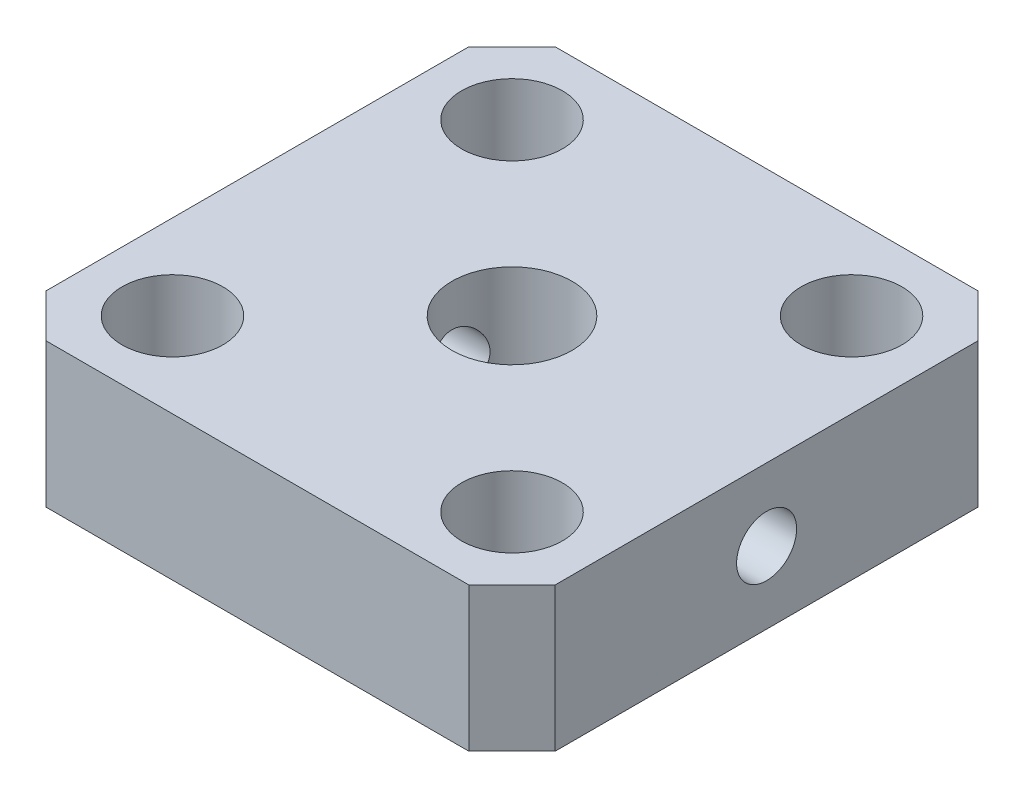
ISO-10303-21;
HEADER;
FILE_DESCRIPTION(('STEP AP214'),'2;1');
FILE_NAME('part.step','',(''),(''),'','','');
FILE_SCHEMA(('AUTOMOTIVE_DESIGN { 1 0 10303 214 1 1 1 1 }'));
ENDSEC;
DATA;
#1=APPLICATION_CONTEXT('core data for automotive mechanical design processes');
#2=APPLICATION_PROTOCOL_DEFINITION('international standard','automotive_design',2000,#1);
#3=PRODUCT_CONTEXT('',#1,'mechanical');
#4=PRODUCT('Part','Part','',(#3));
#5=PRODUCT_RELATED_PRODUCT_CATEGORY('part','',(#4));
#6=PRODUCT_DEFINITION_FORMATION('','',#4);
#7=PRODUCT_DEFINITION_CONTEXT('part definition',#1,'design');
#8=PRODUCT_DEFINITION('design','',#6,#7);
#9=PRODUCT_DEFINITION_SHAPE('','',#8);
#10=(LENGTH_UNIT() NAMED_UNIT(*) SI_UNIT(.MILLI.,.METRE.));
#11=(NAMED_UNIT(*) PLANE_ANGLE_UNIT() SI_UNIT($,.RADIAN.));
#12=(NAMED_UNIT(*) SI_UNIT($,.STERADIAN.) SOLID_ANGLE_UNIT());
#13=UNCERTAINTY_MEASURE_WITH_UNIT(LENGTH_MEASURE(1.E-05),#10,'distance_accuracy_value','');
#14=(GEOMETRIC_REPRESENTATION_CONTEXT(3) GLOBAL_UNCERTAINTY_ASSIGNED_CONTEXT((#13)) GLOBAL_UNIT_ASSIGNED_CONTEXT((#10,
#11,#12)) REPRESENTATION_CONTEXT('',''));
#15=CARTESIAN_POINT('',(0.,0.,0.));
#16=DIRECTION('',(0.,0.,1.));
#17=DIRECTION('',(1.,0.,0.));
#18=AXIS2_PLACEMENT_3D('',#15,#16,#17);
#19=CARTESIAN_POINT('',(0.,6.,0.));
#20=DIRECTION('',(0.,1.,0.));
#21=DIRECTION('',(0.,0.,1.));
#22=AXIS2_PLACEMENT_3D('',#19,#20,#21);
#23=PLANE('',#22);
#24=CARTESIAN_POINT('',(-7.07106781186546,6.,-7.07106781186549));
#25=DIRECTION('',(0.,1.,0.));
#26=DIRECTION('',(0.,0.,1.));
#27=AXIS2_PLACEMENT_3D('',#24,#25,#26);
#28=CIRCLE('',#27,2.09999999999999);
#29=CARTESIAN_POINT('',(-7.07106781186546,6.,-4.9710678118655));
#30=VERTEX_POINT('',#29);
#31=EDGE_CURVE('E272',#30,#30,#28,.T.);
#32=ORIENTED_EDGE('',*,*,#31,.F.);
#33=EDGE_LOOP('',(#32));
#34=FACE_BOUND('',#33,.T.);
#35=CARTESIAN_POINT('',(-7.07106781186546,6.,7.07106781186549));
#36=DIRECTION('',(0.,1.,0.));
#37=DIRECTION('',(0.,0.,1.));
#38=AXIS2_PLACEMENT_3D('',#35,#36,#37);
#39=CIRCLE('',#38,2.09999999999999);
#40=CARTESIAN_POINT('',(-7.07106781186546,6.,9.17106781186548));
#41=VERTEX_POINT('',#40);
#42=EDGE_CURVE('E266',#41,#41,#39,.T.);
#43=ORIENTED_EDGE('',*,*,#42,.F.);
#44=EDGE_LOOP('',(#43));
#45=FACE_BOUND('',#44,.T.);
#46=CARTESIAN_POINT('',(7.07106781186546,6.,7.07106781186549));
#47=DIRECTION('',(0.,1.,0.));
#48=DIRECTION('',(0.,0.,1.));
#49=AXIS2_PLACEMENT_3D('',#46,#47,#48);
#50=CIRCLE('',#49,2.09999999999999);
#51=CARTESIAN_POINT('',(7.07106781186546,6.,9.17106781186548));
#52=VERTEX_POINT('',#51);
#53=EDGE_CURVE('E260',#52,#52,#50,.T.);
#54=ORIENTED_EDGE('',*,*,#53,.F.);
#55=EDGE_LOOP('',(#54));
#56=FACE_BOUND('',#55,.T.);
#57=CARTESIAN_POINT('',(7.07106781186546,6.,-7.07106781186549));
#58=DIRECTION('',(0.,1.,0.));
#59=DIRECTION('',(0.,0.,1.));
#60=AXIS2_PLACEMENT_3D('',#57,#58,#59);
#61=CIRCLE('',#60,2.09999999999999);
#62=CARTESIAN_POINT('',(7.07106781186546,6.,-4.9710678118655));
#63=VERTEX_POINT('',#62);
#64=EDGE_CURVE('E254',#63,#63,#61,.T.);
#65=ORIENTED_EDGE('',*,*,#64,.F.);
#66=EDGE_LOOP('',(#65));
#67=FACE_BOUND('',#66,.T.);
#68=DIRECTION('',(0.,0.,-1.));
#69=VECTOR('',#68,1.);
#70=CARTESIAN_POINT('',(10.605,6.,10.605));
#71=LINE('',#70,#69);
#72=CARTESIAN_POINT('',(10.605,6.,8.80499999999999));
#73=VERTEX_POINT('',#72);
#74=CARTESIAN_POINT('',(10.605,6.,-8.80499999999999));
#75=VERTEX_POINT('',#74);
#76=EDGE_CURVE('E245',#73,#75,#71,.T.);
#77=ORIENTED_EDGE('',*,*,#76,.T.);
#78=DIRECTION('',(0.707106781186546,0.,0.707106781186549));
#79=VECTOR('',#78,1.);
#80=CARTESIAN_POINT('',(9.70500000000002,6.,-9.70499999999998));
#81=LINE('',#80,#79);
#82=CARTESIAN_POINT('',(8.805,6.,-10.605));
#83=VERTEX_POINT('',#82);
#84=EDGE_CURVE('E221',#75,#83,#81,.F.);
#85=ORIENTED_EDGE('',*,*,#84,.T.);
#86=DIRECTION('',(-1.,0.,0.));
#87=VECTOR('',#86,1.);
#88=CARTESIAN_POINT('',(10.605,6.,-10.605));
#89=LINE('',#88,#87);
#90=CARTESIAN_POINT('',(-8.80499999999999,6.,-10.605));
#91=VERTEX_POINT('',#90);
#92=EDGE_CURVE('E121',#83,#91,#89,.T.);
#93=ORIENTED_EDGE('',*,*,#92,.T.);
#94=DIRECTION('',(0.707106781186548,0.,-0.707106781186547));
#95=VECTOR('',#94,1.);
#96=CARTESIAN_POINT('',(-9.70499999999999,6.,-9.70500000000001));
#97=LINE('',#96,#95);
#98=CARTESIAN_POINT('',(-10.605,6.,-8.805));
#99=VERTEX_POINT('',#98);
#100=EDGE_CURVE('E218',#91,#99,#97,.F.);
#101=ORIENTED_EDGE('',*,*,#100,.T.);
#102=DIRECTION('',(0.,0.,1.));
#103=VECTOR('',#102,1.);
#104=CARTESIAN_POINT('',(-10.605,6.,10.605));
#105=LINE('',#104,#103);
#106=CARTESIAN_POINT('',(-10.605,6.,8.805));
#107=VERTEX_POINT('',#106);
#108=EDGE_CURVE('E128',#99,#107,#105,.T.);
#109=ORIENTED_EDGE('',*,*,#108,.T.);
#110=DIRECTION('',(-0.707106781186546,0.,-0.707106781186549));
#111=VECTOR('',#110,1.);
#112=CARTESIAN_POINT('',(-9.70500000000002,6.,9.70499999999998));
#113=LINE('',#112,#111);
#114=CARTESIAN_POINT('',(-8.805,6.,10.605));
#115=VERTEX_POINT('',#114);
#116=EDGE_CURVE('E56',#107,#115,#113,.F.);
#117=ORIENTED_EDGE('',*,*,#116,.T.);
#118=DIRECTION('',(1.,0.,0.));
#119=VECTOR('',#118,1.);
#120=CARTESIAN_POINT('',(10.605,6.,10.605));
#121=LINE('',#120,#119);
#122=CARTESIAN_POINT('',(8.80499999999999,6.,10.605));
#123=VERTEX_POINT('',#122);
#124=EDGE_CURVE('E131',#115,#123,#121,.T.);
#125=ORIENTED_EDGE('',*,*,#124,.T.);
#126=DIRECTION('',(-0.707106781186549,0.,0.707106781186546));
#127=VECTOR('',#126,1.);
#128=CARTESIAN_POINT('',(9.70499999999998,6.,9.70500000000001));
#129=LINE('',#128,#127);
#130=EDGE_CURVE('E219',#123,#73,#129,.F.);
#131=ORIENTED_EDGE('',*,*,#130,.T.);
#132=EDGE_LOOP('',(#77,#85,#93,#101,#109,#117,#125,#131));
#133=FACE_BOUND('',#132,.T.);
#134=CARTESIAN_POINT('',(0.,6.,0.));
#135=DIRECTION('',(0.,1.,0.));
#136=DIRECTION('',(0.,0.,1.));
#137=AXIS2_PLACEMENT_3D('',#134,#135,#136);
#138=CIRCLE('',#137,2.5);
#139=CARTESIAN_POINT('',(0.,6.,2.5));
#140=VERTEX_POINT('',#139);
#141=EDGE_CURVE('E238',#140,#140,#138,.T.);
#142=ORIENTED_EDGE('',*,*,#141,.F.);
#143=EDGE_LOOP('',(#142));
#144=FACE_BOUND('',#143,.T.);
#145=ADVANCED_FACE('F35',(#34,#45,#56,#67,#133,#144),#23,.T.);
#146=CARTESIAN_POINT('',(0.,0.,0.));
#147=DIRECTION('',(0.,1.,0.));
#148=DIRECTION('',(0.,0.,1.));
#149=AXIS2_PLACEMENT_3D('',#146,#147,#148);
#150=PLANE('',#149);
#151=CARTESIAN_POINT('',(-7.07106781186546,0.,-7.07106781186549));
#152=DIRECTION('',(0.,1.,0.));
#153=DIRECTION('',(0.,0.,1.));
#154=AXIS2_PLACEMENT_3D('',#151,#152,#153);
#155=CIRCLE('',#154,2.1);
#156=CARTESIAN_POINT('',(-7.07106781186546,0.,-4.97106781186549));
#157=VERTEX_POINT('',#156);
#158=EDGE_CURVE('E269',#157,#157,#155,.T.);
#159=ORIENTED_EDGE('',*,*,#158,.T.);
#160=EDGE_LOOP('',(#159));
#161=FACE_BOUND('',#160,.T.);
#162=CARTESIAN_POINT('',(-7.07106781186546,0.,7.07106781186549));
#163=DIRECTION('',(0.,1.,0.));
#164=DIRECTION('',(0.,0.,1.));
#165=AXIS2_PLACEMENT_3D('',#162,#163,#164);
#166=CIRCLE('',#165,2.1);
#167=CARTESIAN_POINT('',(-7.07106781186546,0.,9.17106781186549));
#168=VERTEX_POINT('',#167);
#169=EDGE_CURVE('E263',#168,#168,#166,.T.);
#170=ORIENTED_EDGE('',*,*,#169,.T.);
#171=EDGE_LOOP('',(#170));
#172=FACE_BOUND('',#171,.T.);
#173=CARTESIAN_POINT('',(7.07106781186546,0.,7.07106781186549));
#174=DIRECTION('',(0.,1.,0.));
#175=DIRECTION('',(0.,0.,1.));
#176=AXIS2_PLACEMENT_3D('',#173,#174,#175);
#177=CIRCLE('',#176,2.1);
#178=CARTESIAN_POINT('',(7.07106781186546,0.,9.17106781186549));
#179=VERTEX_POINT('',#178);
#180=EDGE_CURVE('E257',#179,#179,#177,.T.);
#181=ORIENTED_EDGE('',*,*,#180,.T.);
#182=EDGE_LOOP('',(#181));
#183=FACE_BOUND('',#182,.T.);
#184=CARTESIAN_POINT('',(7.07106781186546,0.,-7.07106781186549));
#185=DIRECTION('',(0.,1.,0.));
#186=DIRECTION('',(0.,0.,1.));
#187=AXIS2_PLACEMENT_3D('',#184,#185,#186);
#188=CIRCLE('',#187,2.1);
#189=CARTESIAN_POINT('',(7.07106781186546,0.,-4.97106781186549));
#190=VERTEX_POINT('',#189);
#191=EDGE_CURVE('E250',#190,#190,#188,.T.);
#192=ORIENTED_EDGE('',*,*,#191,.T.);
#193=EDGE_LOOP('',(#192));
#194=FACE_BOUND('',#193,.T.);
#195=DIRECTION('',(-1.,0.,0.));
#196=VECTOR('',#195,1.);
#197=CARTESIAN_POINT('',(10.605,0.,-10.605));
#198=LINE('',#197,#196);
#199=CARTESIAN_POINT('',(8.805,0.,-10.605));
#200=VERTEX_POINT('',#199);
#201=CARTESIAN_POINT('',(-8.805,0.,-10.605));
#202=VERTEX_POINT('',#201);
#203=EDGE_CURVE('E118',#200,#202,#198,.T.);
#204=ORIENTED_EDGE('',*,*,#203,.F.);
#205=DIRECTION('',(-0.707106781186546,0.,-0.707106781186549));
#206=VECTOR('',#205,1.);
#207=CARTESIAN_POINT('',(8.805,0.,-10.605));
#208=LINE('',#207,#206);
#209=CARTESIAN_POINT('',(10.605,0.,-8.805));
#210=VERTEX_POINT('',#209);
#211=EDGE_CURVE('E101',#200,#210,#208,.F.);
#212=ORIENTED_EDGE('',*,*,#211,.T.);
#213=DIRECTION('',(0.,0.,-1.));
#214=VECTOR('',#213,1.);
#215=CARTESIAN_POINT('',(10.605,0.,10.605));
#216=LINE('',#215,#214);
#217=CARTESIAN_POINT('',(10.605,0.,8.80499999999999));
#218=VERTEX_POINT('',#217);
#219=EDGE_CURVE('E129',#218,#210,#216,.T.);
#220=ORIENTED_EDGE('',*,*,#219,.F.);
#221=DIRECTION('',(0.707106781186549,0.,-0.707106781186546));
#222=VECTOR('',#221,1.);
#223=CARTESIAN_POINT('',(10.605,0.,8.80499999999999));
#224=LINE('',#223,#222);
#225=CARTESIAN_POINT('',(8.80499999999999,0.,10.605));
#226=VERTEX_POINT('',#225);
#227=EDGE_CURVE('E122',#218,#226,#224,.F.);
#228=ORIENTED_EDGE('',*,*,#227,.T.);
#229=DIRECTION('',(1.,0.,0.));
#230=VECTOR('',#229,1.);
#231=CARTESIAN_POINT('',(10.605,0.,10.605));
#232=LINE('',#231,#230);
#233=CARTESIAN_POINT('',(-8.80499999999999,0.,10.605));
#234=VERTEX_POINT('',#233);
#235=EDGE_CURVE('E133',#234,#226,#232,.T.);
#236=ORIENTED_EDGE('',*,*,#235,.F.);
#237=DIRECTION('',(0.707106781186546,0.,0.707106781186549));
#238=VECTOR('',#237,1.);
#239=CARTESIAN_POINT('',(-8.805,0.,10.605));
#240=LINE('',#239,#238);
#241=CARTESIAN_POINT('',(-10.605,0.,8.80499999999999));
#242=VERTEX_POINT('',#241);
#243=EDGE_CURVE('E237',#234,#242,#240,.F.);
#244=ORIENTED_EDGE('',*,*,#243,.T.);
#245=DIRECTION('',(0.,0.,1.));
#246=VECTOR('',#245,1.);
#247=CARTESIAN_POINT('',(-10.605,0.,10.605));
#248=LINE('',#247,#246);
#249=CARTESIAN_POINT('',(-10.605,0.,-8.805));
#250=VERTEX_POINT('',#249);
#251=EDGE_CURVE('E234',#250,#242,#248,.T.);
#252=ORIENTED_EDGE('',*,*,#251,.F.);
#253=DIRECTION('',(-0.707106781186548,0.,0.707106781186547));
#254=VECTOR('',#253,1.);
#255=CARTESIAN_POINT('',(-10.605,0.,-8.805));
#256=LINE('',#255,#254);
#257=EDGE_CURVE('E112',#250,#202,#256,.F.);
#258=ORIENTED_EDGE('',*,*,#257,.T.);
#259=EDGE_LOOP('',(#204,#212,#220,#228,#236,#244,#252,#258));
#260=FACE_BOUND('',#259,.T.);
#261=CARTESIAN_POINT('',(0.,0.,0.));
#262=DIRECTION('',(0.,1.,0.));
#263=DIRECTION('',(0.,0.,1.));
#264=AXIS2_PLACEMENT_3D('',#261,#262,#263);
#265=CIRCLE('',#264,2.5);
#266=CARTESIAN_POINT('',(0.,0.,2.5));
#267=VERTEX_POINT('',#266);
#268=EDGE_CURVE('E241',#267,#267,#265,.T.);
#269=ORIENTED_EDGE('',*,*,#268,.T.);
#270=EDGE_LOOP('',(#269));
#271=FACE_BOUND('',#270,.T.);
#272=ADVANCED_FACE('F125',(#161,#172,#183,#194,#260,#271),#150,.F.);
#273=CARTESIAN_POINT('',(-10.605,6.,10.605));
#274=DIRECTION('',(1.,0.,0.));
#275=DIRECTION('',(0.,0.,-1.));
#276=AXIS2_PLACEMENT_3D('',#273,#274,#275);
#277=PLANE('',#276);
#278=CARTESIAN_POINT('',(-10.605,3.,0.));
#279=DIRECTION('',(1.,0.,0.));
#280=DIRECTION('',(0.,0.,-1.));
#281=AXIS2_PLACEMENT_3D('',#278,#279,#280);
#282=CIRCLE('',#281,1.25);
#283=CARTESIAN_POINT('',(-10.605,3.,-1.25));
#284=VERTEX_POINT('',#283);
#285=EDGE_CURVE('E145',#284,#284,#282,.T.);
#286=ORIENTED_EDGE('',*,*,#285,.T.);
#287=EDGE_LOOP('',(#286));
#288=FACE_BOUND('',#287,.T.);
#289=ORIENTED_EDGE('',*,*,#108,.F.);
#290=DIRECTION('',(0.,-1.,0.));
#291=VECTOR('',#290,1.);
#292=CARTESIAN_POINT('',(-10.605,6.,-8.805));
#293=LINE('',#292,#291);
#294=EDGE_CURVE('E228',#99,#250,#293,.T.);
#295=ORIENTED_EDGE('',*,*,#294,.T.);
#296=ORIENTED_EDGE('',*,*,#251,.T.);
#297=DIRECTION('',(0.,1.,0.));
#298=VECTOR('',#297,1.);
#299=CARTESIAN_POINT('',(-10.605,6.,8.80499999999999));
#300=LINE('',#299,#298);
#301=EDGE_CURVE('E217',#242,#107,#300,.T.);
#302=ORIENTED_EDGE('',*,*,#301,.T.);
#303=EDGE_LOOP('',(#289,#295,#296,#302));
#304=FACE_BOUND('',#303,.T.);
#305=ADVANCED_FACE('F185',(#288,#304),#277,.F.);
#306=CARTESIAN_POINT('',(10.605,6.,10.605));
#307=DIRECTION('',(0.,0.,-1.));
#308=DIRECTION('',(-1.,0.,0.));
#309=AXIS2_PLACEMENT_3D('',#306,#307,#308);
#310=PLANE('',#309);
#311=ORIENTED_EDGE('',*,*,#124,.F.);
#312=DIRECTION('',(0.,-1.,0.));
#313=VECTOR('',#312,1.);
#314=CARTESIAN_POINT('',(-8.805,6.,10.605));
#315=LINE('',#314,#313);
#316=EDGE_CURVE('E11',#115,#234,#315,.T.);
#317=ORIENTED_EDGE('',*,*,#316,.T.);
#318=ORIENTED_EDGE('',*,*,#235,.T.);
#319=DIRECTION('',(0.,1.,0.));
#320=VECTOR('',#319,1.);
#321=CARTESIAN_POINT('',(8.80499999999999,6.,10.605));
#322=LINE('',#321,#320);
#323=EDGE_CURVE('E43',#226,#123,#322,.T.);
#324=ORIENTED_EDGE('',*,*,#323,.T.);
#325=EDGE_LOOP('',(#311,#317,#318,#324));
#326=FACE_BOUND('',#325,.T.);
#327=ADVANCED_FACE('F196',(#326),#310,.F.);
#328=CARTESIAN_POINT('',(10.605,6.,10.605));
#329=DIRECTION('',(-1.,0.,0.));
#330=DIRECTION('',(0.,0.,1.));
#331=AXIS2_PLACEMENT_3D('',#328,#329,#330);
#332=PLANE('',#331);
#333=CARTESIAN_POINT('',(10.605,3.,0.));
#334=DIRECTION('',(1.,0.,0.));
#335=DIRECTION('',(0.,0.,-1.));
#336=AXIS2_PLACEMENT_3D('',#333,#334,#335);
#337=CIRCLE('',#336,1.25);
#338=CARTESIAN_POINT('',(10.605,3.,-1.25));
#339=VERTEX_POINT('',#338);
#340=EDGE_CURVE('E277',#339,#339,#337,.T.);
#341=ORIENTED_EDGE('',*,*,#340,.F.);
#342=EDGE_LOOP('',(#341));
#343=FACE_BOUND('',#342,.T.);
#344=ORIENTED_EDGE('',*,*,#219,.T.);
#345=DIRECTION('',(0.,1.,0.));
#346=VECTOR('',#345,1.);
#347=CARTESIAN_POINT('',(10.605,6.,-8.805));
#348=LINE('',#347,#346);
#349=EDGE_CURVE('E106',#210,#75,#348,.T.);
#350=ORIENTED_EDGE('',*,*,#349,.T.);
#351=ORIENTED_EDGE('',*,*,#76,.F.);
#352=DIRECTION('',(0.,-1.,0.));
#353=VECTOR('',#352,1.);
#354=CARTESIAN_POINT('',(10.605,6.,8.80499999999999));
#355=LINE('',#354,#353);
#356=EDGE_CURVE('E111',#73,#218,#355,.T.);
#357=ORIENTED_EDGE('',*,*,#356,.T.);
#358=EDGE_LOOP('',(#344,#350,#351,#357));
#359=FACE_BOUND('',#358,.T.);
#360=ADVANCED_FACE('F193',(#343,#359),#332,.F.);
#361=CARTESIAN_POINT('',(10.605,6.,-10.605));
#362=DIRECTION('',(0.,0.,1.));
#363=DIRECTION('',(1.,0.,0.));
#364=AXIS2_PLACEMENT_3D('',#361,#362,#363);
#365=PLANE('',#364);
#366=ORIENTED_EDGE('',*,*,#92,.F.);
#367=DIRECTION('',(0.,-1.,0.));
#368=VECTOR('',#367,1.);
#369=CARTESIAN_POINT('',(8.805,6.,-10.605));
#370=LINE('',#369,#368);
#371=EDGE_CURVE('E105',#83,#200,#370,.T.);
#372=ORIENTED_EDGE('',*,*,#371,.T.);
#373=ORIENTED_EDGE('',*,*,#203,.T.);
#374=DIRECTION('',(0.,1.,0.));
#375=VECTOR('',#374,1.);
#376=CARTESIAN_POINT('',(-8.805,6.,-10.605));
#377=LINE('',#376,#375);
#378=EDGE_CURVE('E123',#202,#91,#377,.T.);
#379=ORIENTED_EDGE('',*,*,#378,.T.);
#380=EDGE_LOOP('',(#366,#372,#373,#379));
#381=FACE_BOUND('',#380,.T.);
#382=ADVANCED_FACE('F117',(#381),#365,.F.);
#383=CARTESIAN_POINT('',(0.,6.,0.));
#384=DIRECTION('',(0.,-1.,0.));
#385=DIRECTION('',(0.,0.,-1.));
#386=AXIS2_PLACEMENT_3D('',#383,#384,#385);
#387=CYLINDRICAL_SURFACE('',#386,2.5);
#388=CARTESIAN_POINT('',(-2.1650635094611,3.,-1.25));
#389=CARTESIAN_POINT('',(-2.16506918410574,3.06513476024406,-1.24999545384316));
#390=CARTESIAN_POINT('',(-2.16804751484696,3.13035176440631,-1.24487496341652));
#391=CARTESIAN_POINT('',(-2.17952958065066,3.25878408084644,-1.22465401237256));
#392=CARTESIAN_POINT('',(-2.18804492569449,3.32199489380426,-1.20953258069272));
#393=CARTESIAN_POINT('',(-2.20936683256748,3.44431458042993,-1.17012493587476));
#394=CARTESIAN_POINT('',(-2.22215054341565,3.50344331559198,-1.14588744061716));
#395=CARTESIAN_POINT('',(-2.25053331021073,3.6167802524959,-1.08908440672046));
#396=CARTESIAN_POINT('',(-2.26613251845081,3.67098818782807,-1.05651841754472));
#397=CARTESIAN_POINT('',(-2.29996086321802,3.77788216069688,-0.980833175663597));
#398=CARTESIAN_POINT('',(-2.31830079547442,3.83007391959193,-0.937065045179711));
#399=CARTESIAN_POINT('',(-2.35464978482132,3.92676048550839,-0.841567259518083));
#400=CARTESIAN_POINT('',(-2.37265867289063,3.9712514532294,-0.789833657227864));
#401=CARTESIAN_POINT('',(-2.40776846191187,4.05420893893458,-0.675611954268181));
#402=CARTESIAN_POINT('',(-2.42472633022716,4.09206720982441,-0.612633986265717));
#403=CARTESIAN_POINT('',(-2.45438445124411,4.1564260665572,-0.480196283249379));
#404=CARTESIAN_POINT('',(-2.46708738979677,4.18293382017146,-0.410740672672693));
#405=CARTESIAN_POINT('',(-2.48600576555297,4.22188082662637,-0.272556179907471));
#406=CARTESIAN_POINT('',(-2.49261850276115,4.23518690794441,-0.204127238111021));
#407=CARTESIAN_POINT('',(-2.50009479807584,4.2502076483438,-0.0657132858723099));
#408=CARTESIAN_POINT('',(-2.50096183480737,4.25192932099464,0.00427075730467318));
#409=CARTESIAN_POINT('',(-2.49703727395563,4.24406665753706,0.137290655529687));
#410=CARTESIAN_POINT('',(-2.49273119865201,4.23545248059847,0.200401498970989));
#411=CARTESIAN_POINT('',(-2.47967806574685,4.20889894511918,0.324142214897902));
#412=CARTESIAN_POINT('',(-2.47093067582992,4.19095888877972,0.384771901367406));
#413=CARTESIAN_POINT('',(-2.44964479109568,4.14614679238773,0.502886739461941));
#414=CARTESIAN_POINT('',(-2.43705551911499,4.11915460853491,0.560316779393972));
#415=CARTESIAN_POINT('',(-2.40922057483359,4.05717072974813,0.66997100189166));
#416=CARTESIAN_POINT('',(-2.39397395196855,4.02217617087206,0.722193311048306));
#417=CARTESIAN_POINT('',(-2.36055492999037,3.94138081058373,0.825217076122743));
#418=CARTESIAN_POINT('',(-2.34224219997719,3.89487121459249,0.8754175937867));
#419=CARTESIAN_POINT('',(-2.30567925733515,3.79426284383728,0.967630462872224));
#420=CARTESIAN_POINT('',(-2.28742910332036,3.74015828465742,1.00963651446779));
#421=CARTESIAN_POINT('',(-2.25180195115606,3.62168975946989,1.08688166830276));
#422=CARTESIAN_POINT('',(-2.23455399988385,3.55689247118223,1.12152164372256));
#423=CARTESIAN_POINT('',(-2.2046931284822,3.42132791080125,1.17914889125154));
#424=CARTESIAN_POINT('',(-2.19207537557584,3.35056695872805,1.20214832276361));
#425=CARTESIAN_POINT('',(-2.17430794771293,3.21098186089651,1.2339752637813));
#426=CARTESIAN_POINT('',(-2.16864569810621,3.14244860119556,1.24378140264997));
#427=CARTESIAN_POINT('',(-2.16397399202012,3.00449832310432,1.25189618326428));
#428=CARTESIAN_POINT('',(-2.1649598361164,2.93508196360027,1.25021294664378));
#429=CARTESIAN_POINT('',(-2.17292920675731,2.80543260177659,1.23629505417996));
#430=CARTESIAN_POINT('',(-2.17924484383318,2.74502568611509,1.22523477089058));
#431=CARTESIAN_POINT('',(-2.19617526939177,2.6270402671613,1.19462035579055));
#432=CARTESIAN_POINT('',(-2.20679145006293,2.56946268656674,1.17506347327952));
#433=CARTESIAN_POINT('',(-2.23170277599571,2.45573583637163,1.12705948575611));
#434=CARTESIAN_POINT('',(-2.24614554053829,2.39977622893306,1.0982425796159));
#435=CARTESIAN_POINT('',(-2.27695149371562,2.29316341057626,1.03285883001975));
#436=CARTESIAN_POINT('',(-2.29331566693935,2.2425129456084,0.996288005415268));
#437=CARTESIAN_POINT('',(-2.3285999807042,2.14127654059557,0.911046458998565));
#438=CARTESIAN_POINT('',(-2.34758228942862,2.09150356160293,0.861431590393706));
#439=CARTESIAN_POINT('',(-2.38417793722366,2.00073470250801,0.754255619247859));
#440=CARTESIAN_POINT('',(-2.40179081259637,1.95974178721183,0.696691843319182));
#441=CARTESIAN_POINT('',(-2.43426702113696,1.88678284256237,0.573169203198445));
#442=CARTESIAN_POINT('',(-2.44904552090037,1.85508360223636,0.50702887196764));
#443=CARTESIAN_POINT('',(-2.47354193699126,1.80357762017826,0.369402955801351));
#444=CARTESIAN_POINT('',(-2.48326429595466,1.78376043579212,0.297922126740219));
#445=CARTESIAN_POINT('',(-2.49584385227354,1.75828929478167,0.158724602913021));
#446=CARTESIAN_POINT('',(-2.49924909885239,1.75150265515486,0.0912643048130705));
#447=CARTESIAN_POINT('',(-2.50052662968914,1.748945918182,-0.0439074824390051));
#448=CARTESIAN_POINT('',(-2.49840085083613,1.75317196434555,-0.111618875368859));
#449=CARTESIAN_POINT('',(-2.48917461047403,1.77177050849453,-0.240672490396434));
#450=CARTESIAN_POINT('',(-2.48241118334988,1.78545606157209,-0.30214039726408));
#451=CARTESIAN_POINT('',(-2.46490117079279,1.82165874912872,-0.421807440229522));
#452=CARTESIAN_POINT('',(-2.45415401415995,1.84417715011682,-0.480006106194386));
#453=CARTESIAN_POINT('',(-2.4290741343515,1.89840881520747,-0.594279257806105));
#454=CARTESIAN_POINT('',(-2.41460771498499,1.9304741540098,-0.650156428375057));
#455=CARTESIAN_POINT('',(-2.38360166427283,2.00244741357382,-0.75596830226753));
#456=CARTESIAN_POINT('',(-2.36706108197951,2.04235893639459,-0.805900259268633));
#457=CARTESIAN_POINT('',(-2.33160762783285,2.13349642377838,-0.903642505196113));
#458=CARTESIAN_POINT('',(-2.31262248764623,2.18545310934649,-0.950747105674089));
#459=CARTESIAN_POINT('',(-2.27578845203566,2.29681340141221,-1.03582910924334));
#460=CARTESIAN_POINT('',(-2.25794057202332,2.35622352608461,-1.07379843751257));
#461=CARTESIAN_POINT('',(-2.22499506631145,2.4832958082262,-1.14053884973207));
#462=CARTESIAN_POINT('',(-2.21000217820338,2.55115941391092,-1.16898133245117));
#463=CARTESIAN_POINT('',(-2.1858269541044,2.69166550542472,-1.21359838688301));
#464=CARTESIAN_POINT('',(-2.17662520184628,2.76429111114086,-1.22981398896918));
#465=CARTESIAN_POINT('',(-2.16911590752238,2.864756694565,-1.24295875983052));
#466=CARTESIAN_POINT('',(-2.1676016125644,2.89170986799735,-1.24559513120481));
#467=CARTESIAN_POINT('',(-2.16557419859688,2.9457706008528,-1.24911675636245));
#468=CARTESIAN_POINT('',(-2.16506114656387,2.97287817048234,-1.25000189299984));
#469=CARTESIAN_POINT('',(-2.1650635094611,3.,-1.25));
#470=B_SPLINE_CURVE_WITH_KNOTS('',3,(#388,#389,#390,#391,#392,#393,#394,#395,#396,#397,#398,
#399,#400,#401,#402,#403,#404,#405,#406,#407,#408,#409,#410,#411,#412,#413,#414,#415,#416,#417,
#418,#419,#420,#421,#422,#423,#424,#425,#426,#427,#428,#429,#430,#431,#432,#433,#434,#435,#436,
#437,#438,#439,#440,#441,#442,#443,#444,#445,#446,#447,#448,#449,#450,#451,#452,#453,#454,#455,
#456,#457,#458,#459,#460,#461,#462,#463,#464,#465,#466,#467,#468,#469),.UNSPECIFIED.,.T.,.F.,(4,
2,2,2,2,2,2,2,2,2,2,2,2,2,2,2,2,2,2,2,2,2,2,2,2,2,2,2,2,2,2,2,2,2,2,2,2,2,2,2,4),(0.,
0.195290153243394,0.390991116031005,0.585660744898606,0.780340906806436,0.991077890622791,
1.20191963855464,1.42697365298454,1.65188533704864,1.86079356209919,2.0695752960755,
2.26020121855673,2.45084140646819,2.64411918413933,2.83746624187839,3.04908989321113,
3.26087560307398,3.4861105216181,3.71110967764631,3.91827863567764,4.12530116485466,
4.30967729280031,4.49411315545078,4.68709120507609,4.88016857775059,5.09758429475766,
5.31507331222752,5.53830226766206,5.76133474760964,5.96390337986858,6.16640108492464,
6.35555531089365,6.54473666890015,6.74200938399339,6.93937287625898,7.15637802312583,
7.37357428556442,7.59763436298255,7.82093916253449,7.90225168981636,7.98356965618175),.UNSPECIFIED.);
#471=CARTESIAN_POINT('',(-2.1650635094611,3.,-1.25));
#472=VERTEX_POINT('',#471);
#473=EDGE_CURVE('E144',#472,#472,#470,.T.);
#474=ORIENTED_EDGE('',*,*,#473,.F.);
#475=EDGE_LOOP('',(#474));
#476=FACE_BOUND('',#475,.T.);
#477=CARTESIAN_POINT('',(2.1650635094611,3.,-1.25));
#478=CARTESIAN_POINT('',(2.16506918410574,2.93486523975594,-1.24999545384316));
#479=CARTESIAN_POINT('',(2.16804751484696,2.86964823559369,-1.24487496341652));
#480=CARTESIAN_POINT('',(2.17952958065065,2.74121591915356,-1.22465401237256));
#481=CARTESIAN_POINT('',(2.18804492569449,2.67800510619574,-1.20953258069272));
#482=CARTESIAN_POINT('',(2.20936683256748,2.55568541957007,-1.17012493587476));
#483=CARTESIAN_POINT('',(2.22215054341565,2.49655668440802,-1.14588744061716));
#484=CARTESIAN_POINT('',(2.25053331021072,2.3832197475041,-1.08908440672046));
#485=CARTESIAN_POINT('',(2.26613251845081,2.32901181217193,-1.05651841754471));
#486=CARTESIAN_POINT('',(2.29996086321802,2.22211783930312,-0.980833175663597));
#487=CARTESIAN_POINT('',(2.31830079547442,2.16992608040807,-0.937065045179711));
#488=CARTESIAN_POINT('',(2.35464978482132,2.07323951449161,-0.841567259518083));
#489=CARTESIAN_POINT('',(2.37265867289062,2.0287485467706,-0.789833657227864));
#490=CARTESIAN_POINT('',(2.40776846191186,1.94579106106542,-0.675611954268181));
#491=CARTESIAN_POINT('',(2.42472633022715,1.90793279017559,-0.612633986265717));
#492=CARTESIAN_POINT('',(2.45438445124411,1.8435739334428,-0.480196283249379));
#493=CARTESIAN_POINT('',(2.46708738979677,1.81706617982854,-0.410740672672693));
#494=CARTESIAN_POINT('',(2.48600576555297,1.77811917337363,-0.272556179907471));
#495=CARTESIAN_POINT('',(2.49261850276115,1.76481309205559,-0.204127238111021));
#496=CARTESIAN_POINT('',(2.50009479807584,1.7497923516562,-0.0657132858723099));
#497=CARTESIAN_POINT('',(2.50096183480737,1.74807067900536,0.00427075730467327));
#498=CARTESIAN_POINT('',(2.49703727395563,1.75593334246294,0.137290655529687));
#499=CARTESIAN_POINT('',(2.492731198652,1.76454751940153,0.200401498970989));
#500=CARTESIAN_POINT('',(2.47967806574684,1.79110105488082,0.324142214897902));
#501=CARTESIAN_POINT('',(2.47093067582992,1.80904111122028,0.384771901367406));
#502=CARTESIAN_POINT('',(2.44964479109568,1.85385320761227,0.502886739461942));
#503=CARTESIAN_POINT('',(2.43705551911499,1.88084539146509,0.560316779393972));
#504=CARTESIAN_POINT('',(2.40922057483359,1.94282927025187,0.66997100189166));
#505=CARTESIAN_POINT('',(2.39397395196855,1.97782382912794,0.722193311048306));
#506=CARTESIAN_POINT('',(2.36055492999036,2.05861918941627,0.825217076122743));
#507=CARTESIAN_POINT('',(2.34224219997719,2.10512878540751,0.8754175937867));
#508=CARTESIAN_POINT('',(2.30567925733514,2.20573715616272,0.967630462872224));
#509=CARTESIAN_POINT('',(2.28742910332036,2.25984171534258,1.00963651446779));
#510=CARTESIAN_POINT('',(2.25180195115606,2.37831024053011,1.08688166830276));
#511=CARTESIAN_POINT('',(2.23455399988384,2.44310752881777,1.12152164372256));
#512=CARTESIAN_POINT('',(2.2046931284822,2.57867208919875,1.17914889125154));
#513=CARTESIAN_POINT('',(2.19207537557584,2.64943304127195,1.20214832276361));
#514=CARTESIAN_POINT('',(2.17430794771293,2.78901813910349,1.2339752637813));
#515=CARTESIAN_POINT('',(2.1686456981062,2.85755139880444,1.24378140264997));
#516=CARTESIAN_POINT('',(2.16397399202012,2.99550167689568,1.25189618326428));
#517=CARTESIAN_POINT('',(2.16495983611639,3.06491803639973,1.25021294664378));
#518=CARTESIAN_POINT('',(2.17292920675731,3.19456739822341,1.23629505417996));
#519=CARTESIAN_POINT('',(2.17924484383318,3.25497431388491,1.22523477089058));
#520=CARTESIAN_POINT('',(2.19617526939176,3.3729597328387,1.19462035579055));
#521=CARTESIAN_POINT('',(2.20679145006292,3.43053731343326,1.17506347327952));
#522=CARTESIAN_POINT('',(2.23170277599571,3.54426416362837,1.12705948575611));
#523=CARTESIAN_POINT('',(2.24614554053829,3.60022377106694,1.0982425796159));
#524=CARTESIAN_POINT('',(2.27695149371562,3.70683658942374,1.03285883001975));
#525=CARTESIAN_POINT('',(2.29331566693934,3.7574870543916,0.996288005415268));
#526=CARTESIAN_POINT('',(2.3285999807042,3.85872345940443,0.911046458998565));
#527=CARTESIAN_POINT('',(2.34758228942861,3.90849643839707,0.861431590393707));
#528=CARTESIAN_POINT('',(2.38417793722365,3.99926529749199,0.754255619247859));
#529=CARTESIAN_POINT('',(2.40179081259636,4.04025821278817,0.696691843319182));
#530=CARTESIAN_POINT('',(2.43426702113696,4.11321715743763,0.573169203198445));
#531=CARTESIAN_POINT('',(2.44904552090036,4.14491639776364,0.50702887196764));
#532=CARTESIAN_POINT('',(2.47354193699126,4.19642237982174,0.369402955801351));
#533=CARTESIAN_POINT('',(2.48326429595466,4.21623956420788,0.297922126740219));
#534=CARTESIAN_POINT('',(2.49584385227353,4.24171070521832,0.15872460291302));
#535=CARTESIAN_POINT('',(2.49924909885239,4.24849734484514,0.0912643048130701));
#536=CARTESIAN_POINT('',(2.50052662968914,4.251054081818,-0.0439074824390054));
#537=CARTESIAN_POINT('',(2.49840085083612,4.24682803565445,-0.111618875368859));
#538=CARTESIAN_POINT('',(2.48917461047403,4.22822949150547,-0.240672490396434));
#539=CARTESIAN_POINT('',(2.48241118334987,4.21454393842791,-0.30214039726408));
#540=CARTESIAN_POINT('',(2.46490117079279,4.17834125087128,-0.421807440229522));
#541=CARTESIAN_POINT('',(2.45415401415994,4.15582284988318,-0.480006106194386));
#542=CARTESIAN_POINT('',(2.4290741343515,4.10159118479253,-0.594279257806105));
#543=CARTESIAN_POINT('',(2.41460771498499,4.0695258459902,-0.650156428375057));
#544=CARTESIAN_POINT('',(2.38360166427282,3.99755258642619,-0.75596830226753));
#545=CARTESIAN_POINT('',(2.36706108197951,3.95764106360541,-0.805900259268633));
#546=CARTESIAN_POINT('',(2.33160762783284,3.86650357622162,-0.903642505196113));
#547=CARTESIAN_POINT('',(2.31262248764622,3.81454689065351,-0.950747105674089));
#548=CARTESIAN_POINT('',(2.27578845203565,3.70318659858779,-1.03582910924334));
#549=CARTESIAN_POINT('',(2.25794057202332,3.64377647391539,-1.07379843751257));
#550=CARTESIAN_POINT('',(2.22499506631145,3.5167041917738,-1.14053884973207));
#551=CARTESIAN_POINT('',(2.21000217820338,3.44884058608908,-1.16898133245117));
#552=CARTESIAN_POINT('',(2.18582695410439,3.30833449457528,-1.21359838688301));
#553=CARTESIAN_POINT('',(2.17662520184627,3.23570888885914,-1.22981398896918));
#554=CARTESIAN_POINT('',(2.16911590752238,3.135243305435,-1.24295875983052));
#555=CARTESIAN_POINT('',(2.1676016125644,3.10829013200264,-1.24559513120481));
#556=CARTESIAN_POINT('',(2.16557419859688,3.0542293991472,-1.24911675636245));
#557=CARTESIAN_POINT('',(2.16506114656387,3.02712182951766,-1.25000189299984));
#558=CARTESIAN_POINT('',(2.1650635094611,3.,-1.25));
#559=B_SPLINE_CURVE_WITH_KNOTS('',3,(#477,#478,#479,#480,#481,#482,#483,#484,#485,#486,#487,
#488,#489,#490,#491,#492,#493,#494,#495,#496,#497,#498,#499,#500,#501,#502,#503,#504,#505,#506,
#507,#508,#509,#510,#511,#512,#513,#514,#515,#516,#517,#518,#519,#520,#521,#522,#523,#524,#525,
#526,#527,#528,#529,#530,#531,#532,#533,#534,#535,#536,#537,#538,#539,#540,#541,#542,#543,#544,
#545,#546,#547,#548,#549,#550,#551,#552,#553,#554,#555,#556,#557,#558),.UNSPECIFIED.,.T.,.F.,(4,
2,2,2,2,2,2,2,2,2,2,2,2,2,2,2,2,2,2,2,2,2,2,2,2,2,2,2,2,2,2,2,2,2,2,2,2,2,2,2,4),(0.,
0.195290153243394,0.390991116031005,0.585660744898607,0.780340906806436,0.991077890622791,
1.20191963855464,1.42697365298454,1.65188533704864,1.86079356209919,2.0695752960755,
2.26020121855673,2.45084140646819,2.64411918413933,2.83746624187839,3.04908989321113,
3.26087560307398,3.4861105216181,3.7111096776463,3.91827863567764,4.12530116485466,
4.30967729280031,4.49411315545078,4.68709120507609,4.88016857775059,5.09758429475766,
5.31507331222752,5.53830226766206,5.76133474760964,5.96390337986858,6.16640108492464,
6.35555531089365,6.54473666890015,6.74200938399339,6.93937287625898,7.15637802312583,
7.37357428556442,7.59763436298255,7.82093916253449,7.90225168981635,7.98356965618174),.UNSPECIFIED.);
#560=CARTESIAN_POINT('',(2.1650635094611,3.,-1.25));
#561=VERTEX_POINT('',#560);
#562=EDGE_CURVE('E137',#561,#561,#559,.T.);
#563=ORIENTED_EDGE('',*,*,#562,.F.);
#564=EDGE_LOOP('',(#563));
#565=FACE_BOUND('',#564,.T.);
#566=ORIENTED_EDGE('',*,*,#141,.T.);
#567=EDGE_LOOP('',(#566));
#568=FACE_BOUND('',#567,.T.);
#569=ORIENTED_EDGE('',*,*,#268,.F.);
#570=EDGE_LOOP('',(#569));
#571=FACE_BOUND('',#570,.T.);
#572=ADVANCED_FACE('F149',(#476,#565,#568,#571),#387,.F.);
#573=CARTESIAN_POINT('',(7.07106781186546,6.,-7.07106781186549));
#574=DIRECTION('',(0.,1.,0.));
#575=DIRECTION('',(0.,0.,1.));
#576=AXIS2_PLACEMENT_3D('',#573,#574,#575);
#577=CYLINDRICAL_SURFACE('',#576,2.09999999999999);
#578=ORIENTED_EDGE('',*,*,#191,.F.);
#579=EDGE_LOOP('',(#578));
#580=FACE_BOUND('',#579,.T.);
#581=ORIENTED_EDGE('',*,*,#64,.T.);
#582=EDGE_LOOP('',(#581));
#583=FACE_BOUND('',#582,.T.);
#584=ADVANCED_FACE('F170',(#580,#583),#577,.F.);
#585=CARTESIAN_POINT('',(7.07106781186546,6.,7.07106781186549));
#586=DIRECTION('',(0.,1.,0.));
#587=DIRECTION('',(0.,0.,1.));
#588=AXIS2_PLACEMENT_3D('',#585,#586,#587);
#589=CYLINDRICAL_SURFACE('',#588,2.09999999999999);
#590=ORIENTED_EDGE('',*,*,#180,.F.);
#591=EDGE_LOOP('',(#590));
#592=FACE_BOUND('',#591,.T.);
#593=ORIENTED_EDGE('',*,*,#53,.T.);
#594=EDGE_LOOP('',(#593));
#595=FACE_BOUND('',#594,.T.);
#596=ADVANCED_FACE('F167',(#592,#595),#589,.F.);
#597=CARTESIAN_POINT('',(-7.07106781186546,6.,7.07106781186549));
#598=DIRECTION('',(0.,1.,0.));
#599=DIRECTION('',(0.,0.,1.));
#600=AXIS2_PLACEMENT_3D('',#597,#598,#599);
#601=CYLINDRICAL_SURFACE('',#600,2.09999999999999);
#602=ORIENTED_EDGE('',*,*,#169,.F.);
#603=EDGE_LOOP('',(#602));
#604=FACE_BOUND('',#603,.T.);
#605=ORIENTED_EDGE('',*,*,#42,.T.);
#606=EDGE_LOOP('',(#605));
#607=FACE_BOUND('',#606,.T.);
#608=ADVANCED_FACE('F163',(#604,#607),#601,.F.);
#609=CARTESIAN_POINT('',(-7.07106781186546,6.,-7.07106781186549));
#610=DIRECTION('',(0.,1.,0.));
#611=DIRECTION('',(0.,0.,1.));
#612=AXIS2_PLACEMENT_3D('',#609,#610,#611);
#613=CYLINDRICAL_SURFACE('',#612,2.09999999999999);
#614=ORIENTED_EDGE('',*,*,#158,.F.);
#615=EDGE_LOOP('',(#614));
#616=FACE_BOUND('',#615,.T.);
#617=ORIENTED_EDGE('',*,*,#31,.T.);
#618=EDGE_LOOP('',(#617));
#619=FACE_BOUND('',#618,.T.);
#620=ADVANCED_FACE('F158',(#616,#619),#613,.F.);
#621=CARTESIAN_POINT('',(10.605,3.,0.));
#622=DIRECTION('',(1.,0.,0.));
#623=DIRECTION('',(0.,0.,-1.));
#624=AXIS2_PLACEMENT_3D('',#621,#622,#623);
#625=CYLINDRICAL_SURFACE('',#624,1.25);
#626=ORIENTED_EDGE('',*,*,#562,.T.);
#627=EDGE_LOOP('',(#626));
#628=FACE_BOUND('',#627,.T.);
#629=ORIENTED_EDGE('',*,*,#340,.T.);
#630=EDGE_LOOP('',(#629));
#631=FACE_BOUND('',#630,.T.);
#632=ADVANCED_FACE('F153',(#628,#631),#625,.F.);
#633=ORIENTED_EDGE('',*,*,#473,.T.);
#634=EDGE_LOOP('',(#633));
#635=FACE_BOUND('',#634,.T.);
#636=ORIENTED_EDGE('',*,*,#285,.F.);
#637=EDGE_LOOP('',(#636));
#638=FACE_BOUND('',#637,.T.);
#639=ADVANCED_FACE('F157',(#635,#638),#625,.F.);
#640=CARTESIAN_POINT('',(8.805,6.,-10.605));
#641=DIRECTION('',(-0.707106781186549,0.,0.707106781186546));
#642=DIRECTION('',(0.,-1.,0.));
#643=AXIS2_PLACEMENT_3D('',#640,#641,#642);
#644=PLANE('',#643);
#645=ORIENTED_EDGE('',*,*,#84,.F.);
#646=ORIENTED_EDGE('',*,*,#349,.F.);
#647=ORIENTED_EDGE('',*,*,#211,.F.);
#648=ORIENTED_EDGE('',*,*,#371,.F.);
#649=EDGE_LOOP('',(#645,#646,#647,#648));
#650=FACE_BOUND('',#649,.T.);
#651=ADVANCED_FACE('F104',(#650),#644,.F.);
#652=CARTESIAN_POINT('',(-10.605,6.,-8.805));
#653=DIRECTION('',(0.707106781186547,0.,0.707106781186548));
#654=DIRECTION('',(0.,-1.,0.));
#655=AXIS2_PLACEMENT_3D('',#652,#653,#654);
#656=PLANE('',#655);
#657=ORIENTED_EDGE('',*,*,#100,.F.);
#658=ORIENTED_EDGE('',*,*,#378,.F.);
#659=ORIENTED_EDGE('',*,*,#257,.F.);
#660=ORIENTED_EDGE('',*,*,#294,.F.);
#661=EDGE_LOOP('',(#657,#658,#659,#660));
#662=FACE_BOUND('',#661,.T.);
#663=ADVANCED_FACE('F205',(#662),#656,.F.);
#664=CARTESIAN_POINT('',(-8.805,6.,10.605));
#665=DIRECTION('',(0.707106781186549,0.,-0.707106781186546));
#666=DIRECTION('',(0.,-1.,0.));
#667=AXIS2_PLACEMENT_3D('',#664,#665,#666);
#668=PLANE('',#667);
#669=ORIENTED_EDGE('',*,*,#116,.F.);
#670=ORIENTED_EDGE('',*,*,#301,.F.);
#671=ORIENTED_EDGE('',*,*,#243,.F.);
#672=ORIENTED_EDGE('',*,*,#316,.F.);
#673=EDGE_LOOP('',(#669,#670,#671,#672));
#674=FACE_BOUND('',#673,.T.);
#675=ADVANCED_FACE('F207',(#674),#668,.F.);
#676=CARTESIAN_POINT('',(10.605,6.,8.80499999999999));
#677=DIRECTION('',(-0.707106781186546,0.,-0.707106781186549));
#678=DIRECTION('',(0.,-1.,0.));
#679=AXIS2_PLACEMENT_3D('',#676,#677,#678);
#680=PLANE('',#679);
#681=ORIENTED_EDGE('',*,*,#130,.F.);
#682=ORIENTED_EDGE('',*,*,#323,.F.);
#683=ORIENTED_EDGE('',*,*,#227,.F.);
#684=ORIENTED_EDGE('',*,*,#356,.F.);
#685=EDGE_LOOP('',(#681,#682,#683,#684));
#686=FACE_BOUND('',#685,.T.);
#687=ADVANCED_FACE('F37',(#686),#680,.F.);
#688=CLOSED_SHELL('',(#145,#272,#305,#327,#360,#382,#572,#584,#596,#608,#620,#632,#639,#651,
#663,#675,#687));
#689=MANIFOLD_SOLID_BREP('B2',#688);
#690=ADVANCED_BREP_SHAPE_REPRESENTATION('',(#18,#689),#14);
#691=SHAPE_DEFINITION_REPRESENTATION(#9,#690);
ENDSEC;
END-ISO-10303-21;
